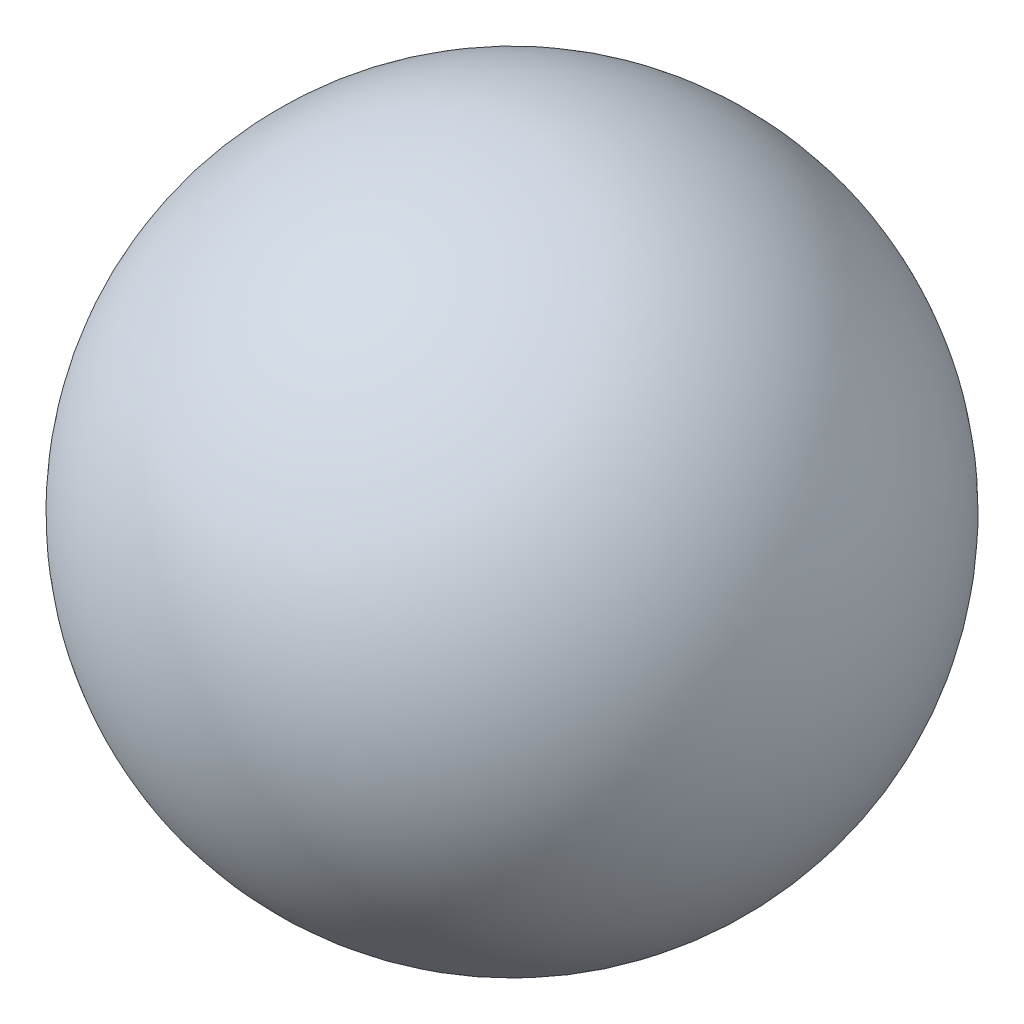
ISO-10303-21;
HEADER;
FILE_DESCRIPTION(('STEP AP214'),'2;1');
FILE_NAME('part.step','',(''),(''),'','','');
FILE_SCHEMA(('AUTOMOTIVE_DESIGN { 1 0 10303 214 1 1 1 1 }'));
ENDSEC;
DATA;
#1=APPLICATION_CONTEXT('core data for automotive mechanical design processes');
#2=APPLICATION_PROTOCOL_DEFINITION('international standard','automotive_design',2000,#1);
#3=PRODUCT_CONTEXT('',#1,'mechanical');
#4=PRODUCT('Part','Part','',(#3));
#5=PRODUCT_RELATED_PRODUCT_CATEGORY('part','',(#4));
#6=PRODUCT_DEFINITION_FORMATION('','',#4);
#7=PRODUCT_DEFINITION_CONTEXT('part definition',#1,'design');
#8=PRODUCT_DEFINITION('design','',#6,#7);
#9=PRODUCT_DEFINITION_SHAPE('','',#8);
#10=(LENGTH_UNIT() NAMED_UNIT(*) SI_UNIT(.MILLI.,.METRE.));
#11=(NAMED_UNIT(*) PLANE_ANGLE_UNIT() SI_UNIT($,.RADIAN.));
#12=(NAMED_UNIT(*) SI_UNIT($,.STERADIAN.) SOLID_ANGLE_UNIT());
#13=UNCERTAINTY_MEASURE_WITH_UNIT(LENGTH_MEASURE(1.E-05),#10,'distance_accuracy_value','');
#14=(GEOMETRIC_REPRESENTATION_CONTEXT(3) GLOBAL_UNCERTAINTY_ASSIGNED_CONTEXT((#13)) GLOBAL_UNIT_ASSIGNED_CONTEXT((#10,
#11,#12)) REPRESENTATION_CONTEXT('',''));
#15=CARTESIAN_POINT('',(0.,0.,0.));
#16=DIRECTION('',(0.,0.,1.));
#17=DIRECTION('',(1.,0.,0.));
#18=AXIS2_PLACEMENT_3D('',#15,#16,#17);
#19=CARTESIAN_POINT('',(-11.1037596198974,-2.,-3.8430485689797));
#20=DIRECTION('',(0.,0.,1.));
#21=DIRECTION('',(1.,0.,0.));
#22=AXIS2_PLACEMENT_3D('',#19,#20,#21);
#23=SPHERICAL_SURFACE('',#22,1.05);
#24=CARTESIAN_POINT('',(-11.1037596198974,-2.,-2.7930485689797));
#25=VERTEX_POINT('',#24);
#26=VERTEX_LOOP('',#25);
#27=FACE_BOUND('',#26,.T.);
#28=ADVANCED_FACE('F12',(#27),#23,.T.);
#29=CLOSED_SHELL('',(#28));
#30=MANIFOLD_SOLID_BREP('B1',#29);
#31=ADVANCED_BREP_SHAPE_REPRESENTATION('',(#18,#30),#14);
#32=SHAPE_DEFINITION_REPRESENTATION(#9,#31);
ENDSEC;
END-ISO-10303-21;
